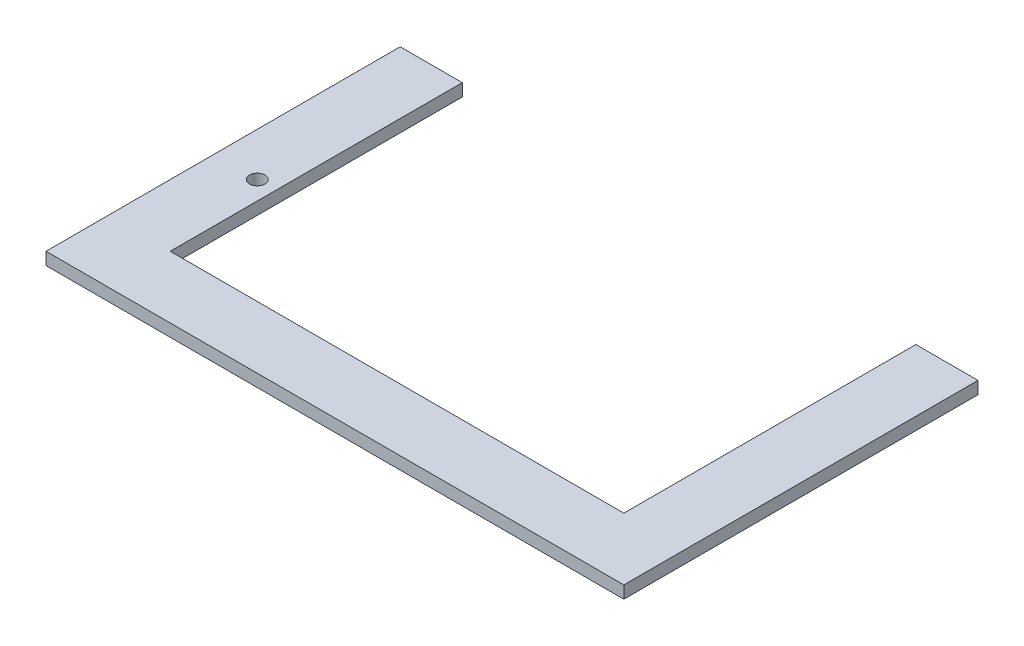
ISO-10303-21;
HEADER;
FILE_DESCRIPTION(('STEP AP214'),'2;1');
FILE_NAME('part.step','',(''),(''),'','','');
FILE_SCHEMA(('AUTOMOTIVE_DESIGN { 1 0 10303 214 1 1 1 1 }'));
ENDSEC;
DATA;
#1=APPLICATION_CONTEXT('core data for automotive mechanical design processes');
#2=APPLICATION_PROTOCOL_DEFINITION('international standard','automotive_design',2000,#1);
#3=PRODUCT_CONTEXT('',#1,'mechanical');
#4=PRODUCT('Part','Part','',(#3));
#5=PRODUCT_RELATED_PRODUCT_CATEGORY('part','',(#4));
#6=PRODUCT_DEFINITION_FORMATION('','',#4);
#7=PRODUCT_DEFINITION_CONTEXT('part definition',#1,'design');
#8=PRODUCT_DEFINITION('design','',#6,#7);
#9=PRODUCT_DEFINITION_SHAPE('','',#8);
#10=(LENGTH_UNIT() NAMED_UNIT(*) SI_UNIT(.MILLI.,.METRE.));
#11=(NAMED_UNIT(*) PLANE_ANGLE_UNIT() SI_UNIT($,.RADIAN.));
#12=(NAMED_UNIT(*) SI_UNIT($,.STERADIAN.) SOLID_ANGLE_UNIT());
#13=UNCERTAINTY_MEASURE_WITH_UNIT(LENGTH_MEASURE(1.E-05),#10,'distance_accuracy_value','');
#14=(GEOMETRIC_REPRESENTATION_CONTEXT(3) GLOBAL_UNCERTAINTY_ASSIGNED_CONTEXT((#13)) GLOBAL_UNIT_ASSIGNED_CONTEXT((#10,
#11,#12)) REPRESENTATION_CONTEXT('',''));
#15=CARTESIAN_POINT('',(0.,0.,0.));
#16=DIRECTION('',(0.,0.,1.));
#17=DIRECTION('',(1.,0.,0.));
#18=AXIS2_PLACEMENT_3D('',#15,#16,#17);
#19=CARTESIAN_POINT('',(-73.0000000000001,-163.491093751232,-163.));
#20=DIRECTION('',(0.,0.,1.));
#21=DIRECTION('',(0.,-1.,0.));
#22=AXIS2_PLACEMENT_3D('',#19,#20,#21);
#23=PLANE('',#22);
#24=DIRECTION('',(-1.,0.,0.));
#25=VECTOR('',#24,1.);
#26=CARTESIAN_POINT('',(-73.0000000000001,-167.491093751232,-163.));
#27=LINE('',#26,#25);
#28=CARTESIAN_POINT('',(-73.0000000000001,-167.491093751232,-163.));
#29=VERTEX_POINT('',#28);
#30=CARTESIAN_POINT('',(-93.0000000000001,-167.491093751232,-163.));
#31=VERTEX_POINT('',#30);
#32=EDGE_CURVE('E137',#29,#31,#27,.T.);
#33=ORIENTED_EDGE('',*,*,#32,.T.);
#34=DIRECTION('',(0.,-1.,0.));
#35=VECTOR('',#34,1.);
#36=CARTESIAN_POINT('',(-93.0000000000001,-163.491093751232,-163.));
#37=LINE('',#36,#35);
#38=CARTESIAN_POINT('',(-93.0000000000001,-163.491093751232,-163.));
#39=VERTEX_POINT('',#38);
#40=EDGE_CURVE('E11',#39,#31,#37,.T.);
#41=ORIENTED_EDGE('',*,*,#40,.F.);
#42=DIRECTION('',(-1.,0.,0.));
#43=VECTOR('',#42,1.);
#44=CARTESIAN_POINT('',(-73.0000000000001,-163.491093751232,-163.));
#45=LINE('',#44,#43);
#46=CARTESIAN_POINT('',(-73.0000000000001,-163.491093751232,-163.));
#47=VERTEX_POINT('',#46);
#48=EDGE_CURVE('E152',#47,#39,#45,.T.);
#49=ORIENTED_EDGE('',*,*,#48,.F.);
#50=DIRECTION('',(0.,-1.,0.));
#51=VECTOR('',#50,1.);
#52=CARTESIAN_POINT('',(-73.0000000000001,-163.491093751232,-163.));
#53=LINE('',#52,#51);
#54=EDGE_CURVE('E133',#47,#29,#53,.T.);
#55=ORIENTED_EDGE('',*,*,#54,.T.);
#56=EDGE_LOOP('',(#33,#41,#49,#55));
#57=FACE_BOUND('',#56,.T.);
#58=ADVANCED_FACE('F41',(#57),#23,.F.);
#59=CARTESIAN_POINT('',(-93.0000000000001,-163.491093751232,-163.));
#60=DIRECTION('',(1.,0.,0.));
#61=DIRECTION('',(0.,0.,-1.));
#62=AXIS2_PLACEMENT_3D('',#59,#60,#61);
#63=PLANE('',#62);
#64=DIRECTION('',(0.,0.,1.));
#65=VECTOR('',#64,1.);
#66=CARTESIAN_POINT('',(-93.0000000000001,-167.491093751232,-163.));
#67=LINE('',#66,#65);
#68=CARTESIAN_POINT('',(-93.,-167.491093751232,-49.));
#69=VERTEX_POINT('',#68);
#70=EDGE_CURVE('E140',#31,#69,#67,.T.);
#71=ORIENTED_EDGE('',*,*,#70,.T.);
#72=DIRECTION('',(0.,-1.,0.));
#73=VECTOR('',#72,1.);
#74=CARTESIAN_POINT('',(-93.,-163.491093751232,-49.));
#75=LINE('',#74,#73);
#76=CARTESIAN_POINT('',(-93.,-163.491093751232,-49.));
#77=VERTEX_POINT('',#76);
#78=EDGE_CURVE('E49',#77,#69,#75,.T.);
#79=ORIENTED_EDGE('',*,*,#78,.F.);
#80=DIRECTION('',(0.,0.,1.));
#81=VECTOR('',#80,1.);
#82=CARTESIAN_POINT('',(-93.0000000000001,-163.491093751232,-163.));
#83=LINE('',#82,#81);
#84=EDGE_CURVE('E100',#39,#77,#83,.T.);
#85=ORIENTED_EDGE('',*,*,#84,.F.);
#86=ORIENTED_EDGE('',*,*,#40,.T.);
#87=EDGE_LOOP('',(#71,#79,#85,#86));
#88=FACE_BOUND('',#87,.T.);
#89=ADVANCED_FACE('F205',(#88),#63,.F.);
#90=CARTESIAN_POINT('',(-93.,-163.491093751232,-49.));
#91=DIRECTION('',(0.,0.,-1.));
#92=DIRECTION('',(0.,1.,0.));
#93=AXIS2_PLACEMENT_3D('',#90,#91,#92);
#94=PLANE('',#93);
#95=DIRECTION('',(1.,0.,0.));
#96=VECTOR('',#95,1.);
#97=CARTESIAN_POINT('',(-93.,-167.491093751232,-49.));
#98=LINE('',#97,#96);
#99=CARTESIAN_POINT('',(93.,-167.491093751232,-49.));
#100=VERTEX_POINT('',#99);
#101=EDGE_CURVE('E143',#69,#100,#98,.T.);
#102=ORIENTED_EDGE('',*,*,#101,.T.);
#103=DIRECTION('',(0.,-1.,0.));
#104=VECTOR('',#103,1.);
#105=CARTESIAN_POINT('',(93.,-163.491093751232,-49.));
#106=LINE('',#105,#104);
#107=CARTESIAN_POINT('',(93.,-163.491093751232,-49.));
#108=VERTEX_POINT('',#107);
#109=EDGE_CURVE('E159',#108,#100,#106,.T.);
#110=ORIENTED_EDGE('',*,*,#109,.F.);
#111=DIRECTION('',(1.,0.,0.));
#112=VECTOR('',#111,1.);
#113=CARTESIAN_POINT('',(-93.,-163.491093751232,-49.));
#114=LINE('',#113,#112);
#115=EDGE_CURVE('E167',#77,#108,#114,.T.);
#116=ORIENTED_EDGE('',*,*,#115,.F.);
#117=ORIENTED_EDGE('',*,*,#78,.T.);
#118=EDGE_LOOP('',(#102,#110,#116,#117));
#119=FACE_BOUND('',#118,.T.);
#120=ADVANCED_FACE('F165',(#119),#94,.F.);
#121=CARTESIAN_POINT('',(93.,-163.491093751232,-49.));
#122=DIRECTION('',(-1.,0.,0.));
#123=DIRECTION('',(0.,0.,1.));
#124=AXIS2_PLACEMENT_3D('',#121,#122,#123);
#125=PLANE('',#124);
#126=DIRECTION('',(0.,0.,-1.));
#127=VECTOR('',#126,1.);
#128=CARTESIAN_POINT('',(93.,-167.491093751232,-49.));
#129=LINE('',#128,#127);
#130=CARTESIAN_POINT('',(93.,-167.491093751232,-163.));
#131=VERTEX_POINT('',#130);
#132=EDGE_CURVE('E145',#100,#131,#129,.T.);
#133=ORIENTED_EDGE('',*,*,#132,.T.);
#134=DIRECTION('',(0.,-1.,0.));
#135=VECTOR('',#134,1.);
#136=CARTESIAN_POINT('',(93.,-163.491093751232,-163.));
#137=LINE('',#136,#135);
#138=CARTESIAN_POINT('',(93.,-163.491093751232,-163.));
#139=VERTEX_POINT('',#138);
#140=EDGE_CURVE('E156',#139,#131,#137,.T.);
#141=ORIENTED_EDGE('',*,*,#140,.F.);
#142=DIRECTION('',(0.,0.,-1.));
#143=VECTOR('',#142,1.);
#144=CARTESIAN_POINT('',(93.,-163.491093751232,-49.));
#145=LINE('',#144,#143);
#146=EDGE_CURVE('E179',#108,#139,#145,.T.);
#147=ORIENTED_EDGE('',*,*,#146,.F.);
#148=ORIENTED_EDGE('',*,*,#109,.T.);
#149=EDGE_LOOP('',(#133,#141,#147,#148));
#150=FACE_BOUND('',#149,.T.);
#151=ADVANCED_FACE('F175',(#150),#125,.F.);
#152=CARTESIAN_POINT('',(93.,-163.491093751232,-163.));
#153=DIRECTION('',(0.,0.,1.));
#154=DIRECTION('',(1.,0.,0.));
#155=AXIS2_PLACEMENT_3D('',#152,#153,#154);
#156=PLANE('',#155);
#157=DIRECTION('',(-1.,0.,0.));
#158=VECTOR('',#157,1.);
#159=CARTESIAN_POINT('',(93.,-167.491093751232,-163.));
#160=LINE('',#159,#158);
#161=CARTESIAN_POINT('',(73.,-167.491093751232,-163.));
#162=VERTEX_POINT('',#161);
#163=EDGE_CURVE('E147',#131,#162,#160,.T.);
#164=ORIENTED_EDGE('',*,*,#163,.T.);
#165=DIRECTION('',(0.,-1.,0.));
#166=VECTOR('',#165,1.);
#167=CARTESIAN_POINT('',(73.,-163.491093751232,-163.));
#168=LINE('',#167,#166);
#169=CARTESIAN_POINT('',(73.,-163.491093751232,-163.));
#170=VERTEX_POINT('',#169);
#171=EDGE_CURVE('E128',#170,#162,#168,.T.);
#172=ORIENTED_EDGE('',*,*,#171,.F.);
#173=DIRECTION('',(-1.,0.,0.));
#174=VECTOR('',#173,1.);
#175=CARTESIAN_POINT('',(93.,-163.491093751232,-163.));
#176=LINE('',#175,#174);
#177=EDGE_CURVE('E119',#139,#170,#176,.T.);
#178=ORIENTED_EDGE('',*,*,#177,.F.);
#179=ORIENTED_EDGE('',*,*,#140,.T.);
#180=EDGE_LOOP('',(#164,#172,#178,#179));
#181=FACE_BOUND('',#180,.T.);
#182=ADVANCED_FACE('F178',(#181),#156,.F.);
#183=CARTESIAN_POINT('',(73.,-163.491093751232,-163.));
#184=DIRECTION('',(1.,0.,0.));
#185=DIRECTION('',(0.,0.,-1.));
#186=AXIS2_PLACEMENT_3D('',#183,#184,#185);
#187=PLANE('',#186);
#188=DIRECTION('',(0.,0.,1.));
#189=VECTOR('',#188,1.);
#190=CARTESIAN_POINT('',(73.,-167.491093751232,-163.));
#191=LINE('',#190,#189);
#192=CARTESIAN_POINT('',(73.,-167.491093751232,-69.));
#193=VERTEX_POINT('',#192);
#194=EDGE_CURVE('E127',#162,#193,#191,.T.);
#195=ORIENTED_EDGE('',*,*,#194,.T.);
#196=DIRECTION('',(0.,-1.,0.));
#197=VECTOR('',#196,1.);
#198=CARTESIAN_POINT('',(73.,-163.491093751232,-69.));
#199=LINE('',#198,#197);
#200=CARTESIAN_POINT('',(73.,-163.491093751232,-69.));
#201=VERTEX_POINT('',#200);
#202=EDGE_CURVE('E124',#201,#193,#199,.T.);
#203=ORIENTED_EDGE('',*,*,#202,.F.);
#204=DIRECTION('',(0.,0.,1.));
#205=VECTOR('',#204,1.);
#206=CARTESIAN_POINT('',(73.,-163.491093751232,-163.));
#207=LINE('',#206,#205);
#208=EDGE_CURVE('E113',#170,#201,#207,.T.);
#209=ORIENTED_EDGE('',*,*,#208,.F.);
#210=ORIENTED_EDGE('',*,*,#171,.T.);
#211=EDGE_LOOP('',(#195,#203,#209,#210));
#212=FACE_BOUND('',#211,.T.);
#213=ADVANCED_FACE('F125',(#212),#187,.F.);
#214=CARTESIAN_POINT('',(73.,-163.491093751232,-69.));
#215=DIRECTION('',(0.,0.,1.));
#216=DIRECTION('',(0.,-1.,0.));
#217=AXIS2_PLACEMENT_3D('',#214,#215,#216);
#218=PLANE('',#217);
#219=DIRECTION('',(-1.,0.,0.));
#220=VECTOR('',#219,1.);
#221=CARTESIAN_POINT('',(73.,-167.491093751232,-69.));
#222=LINE('',#221,#220);
#223=CARTESIAN_POINT('',(-73.0000000000001,-167.491093751232,-69.));
#224=VERTEX_POINT('',#223);
#225=EDGE_CURVE('E86',#193,#224,#222,.T.);
#226=ORIENTED_EDGE('',*,*,#225,.T.);
#227=DIRECTION('',(0.,-1.,0.));
#228=VECTOR('',#227,1.);
#229=CARTESIAN_POINT('',(-73.0000000000001,-163.491093751232,-69.));
#230=LINE('',#229,#228);
#231=CARTESIAN_POINT('',(-73.0000000000001,-163.491093751232,-69.));
#232=VERTEX_POINT('',#231);
#233=EDGE_CURVE('E129',#232,#224,#230,.T.);
#234=ORIENTED_EDGE('',*,*,#233,.F.);
#235=DIRECTION('',(-1.,0.,0.));
#236=VECTOR('',#235,1.);
#237=CARTESIAN_POINT('',(73.,-163.491093751232,-69.));
#238=LINE('',#237,#236);
#239=EDGE_CURVE('E117',#201,#232,#238,.T.);
#240=ORIENTED_EDGE('',*,*,#239,.F.);
#241=ORIENTED_EDGE('',*,*,#202,.T.);
#242=EDGE_LOOP('',(#226,#234,#240,#241));
#243=FACE_BOUND('',#242,.T.);
#244=ADVANCED_FACE('F131',(#243),#218,.F.);
#245=CARTESIAN_POINT('',(-73.0000000000001,-163.491093751232,-69.));
#246=DIRECTION('',(-1.,0.,0.));
#247=DIRECTION('',(0.,0.,1.));
#248=AXIS2_PLACEMENT_3D('',#245,#246,#247);
#249=PLANE('',#248);
#250=DIRECTION('',(0.,0.,-1.));
#251=VECTOR('',#250,1.);
#252=CARTESIAN_POINT('',(-73.0000000000001,-167.491093751232,-69.));
#253=LINE('',#252,#251);
#254=EDGE_CURVE('E92',#224,#29,#253,.T.);
#255=ORIENTED_EDGE('',*,*,#254,.T.);
#256=ORIENTED_EDGE('',*,*,#54,.F.);
#257=DIRECTION('',(0.,0.,-1.));
#258=VECTOR('',#257,1.);
#259=CARTESIAN_POINT('',(-73.0000000000001,-163.491093751232,-69.));
#260=LINE('',#259,#258);
#261=EDGE_CURVE('E57',#232,#47,#260,.T.);
#262=ORIENTED_EDGE('',*,*,#261,.F.);
#263=ORIENTED_EDGE('',*,*,#233,.T.);
#264=EDGE_LOOP('',(#255,#256,#262,#263));
#265=FACE_BOUND('',#264,.T.);
#266=ADVANCED_FACE('F194',(#265),#249,.F.);
#267=CARTESIAN_POINT('',(0.,-163.491093751232,-1.60032247769844E-13));
#268=DIRECTION('',(0.,1.,0.));
#269=DIRECTION('',(0.,0.,1.));
#270=AXIS2_PLACEMENT_3D('',#267,#268,#269);
#271=PLANE('',#270);
#272=CARTESIAN_POINT('',(-79.0000000000001,-163.491093751232,-103.));
#273=DIRECTION('',(0.,1.,0.));
#274=DIRECTION('',(0.,0.,1.));
#275=AXIS2_PLACEMENT_3D('',#272,#273,#274);
#276=CIRCLE('',#275,2.5);
#277=CARTESIAN_POINT('',(-79.0000000000001,-163.491093751232,-100.5));
#278=VERTEX_POINT('',#277);
#279=EDGE_CURVE('E187',#278,#278,#276,.T.);
#280=ORIENTED_EDGE('',*,*,#279,.F.);
#281=EDGE_LOOP('',(#280));
#282=FACE_BOUND('',#281,.T.);
#283=ORIENTED_EDGE('',*,*,#48,.T.);
#284=ORIENTED_EDGE('',*,*,#84,.T.);
#285=ORIENTED_EDGE('',*,*,#115,.T.);
#286=ORIENTED_EDGE('',*,*,#146,.T.);
#287=ORIENTED_EDGE('',*,*,#177,.T.);
#288=ORIENTED_EDGE('',*,*,#208,.T.);
#289=ORIENTED_EDGE('',*,*,#239,.T.);
#290=ORIENTED_EDGE('',*,*,#261,.T.);
#291=EDGE_LOOP('',(#283,#284,#285,#286,#287,#288,#289,#290));
#292=FACE_BOUND('',#291,.T.);
#293=ADVANCED_FACE('F115',(#282,#292),#271,.T.);
#294=CARTESIAN_POINT('',(0.,-167.491093751232,-1.63116200616025E-13));
#295=DIRECTION('',(0.,1.,0.));
#296=DIRECTION('',(0.,0.,1.));
#297=AXIS2_PLACEMENT_3D('',#294,#295,#296);
#298=PLANE('',#297);
#299=CARTESIAN_POINT('',(-79.0000000000001,-167.491093751232,-103.));
#300=DIRECTION('',(0.,1.,0.));
#301=DIRECTION('',(0.,0.,1.));
#302=AXIS2_PLACEMENT_3D('',#299,#300,#301);
#303=CIRCLE('',#302,2.5);
#304=CARTESIAN_POINT('',(-79.0000000000001,-167.491093751232,-100.5));
#305=VERTEX_POINT('',#304);
#306=EDGE_CURVE('E141',#305,#305,#303,.T.);
#307=ORIENTED_EDGE('',*,*,#306,.T.);
#308=EDGE_LOOP('',(#307));
#309=FACE_BOUND('',#308,.T.);
#310=ORIENTED_EDGE('',*,*,#32,.F.);
#311=ORIENTED_EDGE('',*,*,#254,.F.);
#312=ORIENTED_EDGE('',*,*,#225,.F.);
#313=ORIENTED_EDGE('',*,*,#194,.F.);
#314=ORIENTED_EDGE('',*,*,#163,.F.);
#315=ORIENTED_EDGE('',*,*,#132,.F.);
#316=ORIENTED_EDGE('',*,*,#101,.F.);
#317=ORIENTED_EDGE('',*,*,#70,.F.);
#318=EDGE_LOOP('',(#310,#311,#312,#313,#314,#315,#316,#317));
#319=FACE_BOUND('',#318,.T.);
#320=ADVANCED_FACE('F171',(#309,#319),#298,.F.);
#321=CARTESIAN_POINT('',(-79.0000000000001,-163.491093751232,-103.));
#322=DIRECTION('',(0.,1.,0.));
#323=DIRECTION('',(0.,0.,1.));
#324=AXIS2_PLACEMENT_3D('',#321,#322,#323);
#325=CYLINDRICAL_SURFACE('',#324,2.5);
#326=ORIENTED_EDGE('',*,*,#306,.F.);
#327=EDGE_LOOP('',(#326));
#328=FACE_BOUND('',#327,.T.);
#329=ORIENTED_EDGE('',*,*,#279,.T.);
#330=EDGE_LOOP('',(#329));
#331=FACE_BOUND('',#330,.T.);
#332=ADVANCED_FACE('F191',(#328,#331),#325,.F.);
#333=CLOSED_SHELL('',(#58,#89,#120,#151,#182,#213,#244,#266,#293,#320,#332));
#334=MANIFOLD_SOLID_BREP('B2',#333);
#335=ADVANCED_BREP_SHAPE_REPRESENTATION('',(#18,#334),#14);
#336=SHAPE_DEFINITION_REPRESENTATION(#9,#335);
ENDSEC;
END-ISO-10303-21;
